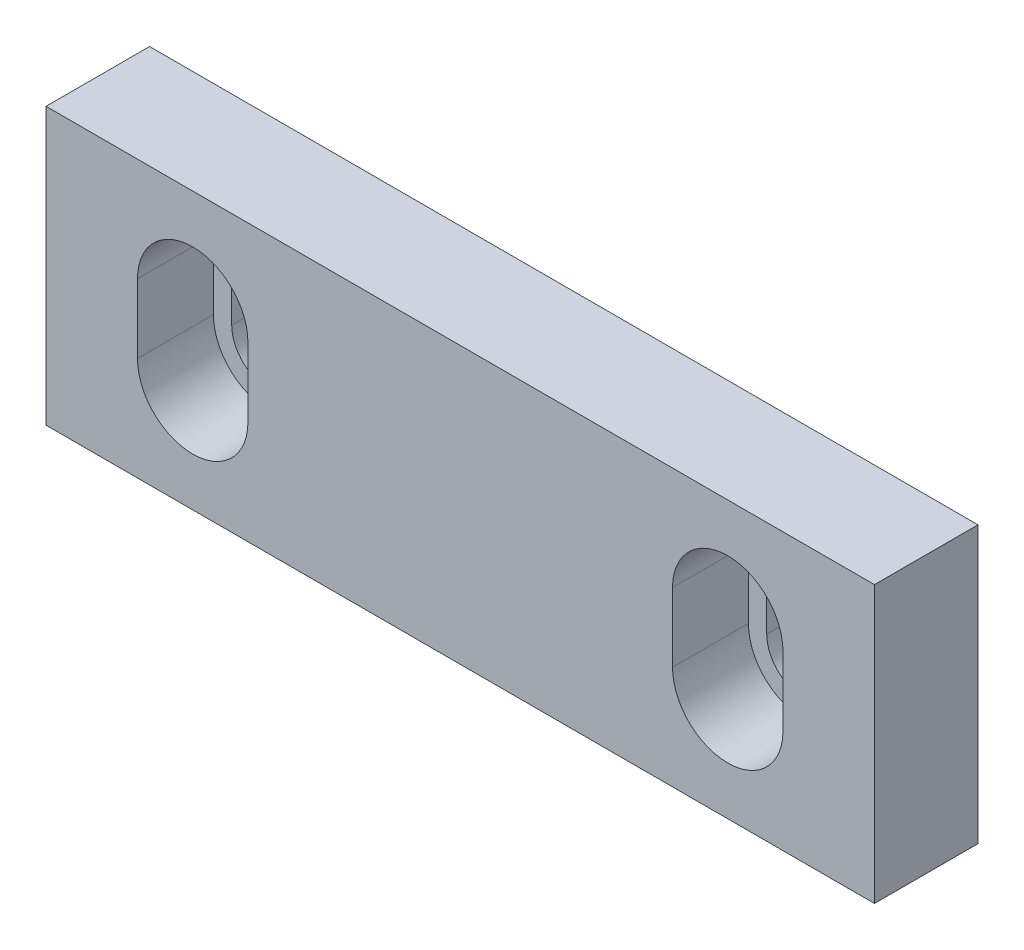
ISO-10303-21;
HEADER;
FILE_DESCRIPTION(('STEP AP214'),'2;1');
FILE_NAME('part.step','',(''),(''),'','','');
FILE_SCHEMA(('AUTOMOTIVE_DESIGN { 1 0 10303 214 1 1 1 1 }'));
ENDSEC;
DATA;
#1=APPLICATION_CONTEXT('core data for automotive mechanical design processes');
#2=APPLICATION_PROTOCOL_DEFINITION('international standard','automotive_design',2000,#1);
#3=PRODUCT_CONTEXT('',#1,'mechanical');
#4=PRODUCT('Part','Part','',(#3));
#5=PRODUCT_RELATED_PRODUCT_CATEGORY('part','',(#4));
#6=PRODUCT_DEFINITION_FORMATION('','',#4);
#7=PRODUCT_DEFINITION_CONTEXT('part definition',#1,'design');
#8=PRODUCT_DEFINITION('design','',#6,#7);
#9=PRODUCT_DEFINITION_SHAPE('','',#8);
#10=(LENGTH_UNIT() NAMED_UNIT(*) SI_UNIT(.MILLI.,.METRE.));
#11=(NAMED_UNIT(*) PLANE_ANGLE_UNIT() SI_UNIT($,.RADIAN.));
#12=(NAMED_UNIT(*) SI_UNIT($,.STERADIAN.) SOLID_ANGLE_UNIT());
#13=UNCERTAINTY_MEASURE_WITH_UNIT(LENGTH_MEASURE(1.E-05),#10,'distance_accuracy_value','');
#14=(GEOMETRIC_REPRESENTATION_CONTEXT(3) GLOBAL_UNCERTAINTY_ASSIGNED_CONTEXT((#13)) GLOBAL_UNIT_ASSIGNED_CONTEXT((#10,
#11,#12)) REPRESENTATION_CONTEXT('',''));
#15=CARTESIAN_POINT('',(0.,0.,0.));
#16=DIRECTION('',(0.,0.,1.));
#17=DIRECTION('',(1.,0.,0.));
#18=AXIS2_PLACEMENT_3D('',#15,#16,#17);
#19=CARTESIAN_POINT('',(0.,25.4,19.05));
#20=DIRECTION('',(0.,-1.,0.));
#21=DIRECTION('',(1.,0.,0.));
#22=AXIS2_PLACEMENT_3D('',#19,#20,#21);
#23=PLANE('',#22);
#24=DIRECTION('',(-1.,0.,0.));
#25=VECTOR('',#24,1.);
#26=CARTESIAN_POINT('',(0.,25.4,0.));
#27=LINE('',#26,#25);
#28=CARTESIAN_POINT('',(76.2,25.4,0.));
#29=VERTEX_POINT('',#28);
#30=CARTESIAN_POINT('',(-76.2,25.4,0.));
#31=VERTEX_POINT('',#30);
#32=EDGE_CURVE('E261',#29,#31,#27,.T.);
#33=ORIENTED_EDGE('',*,*,#32,.T.);
#34=DIRECTION('',(0.,0.,-1.));
#35=VECTOR('',#34,1.);
#36=CARTESIAN_POINT('',(-76.2,25.4,19.05));
#37=LINE('',#36,#35);
#38=CARTESIAN_POINT('',(-76.2,25.4,19.05));
#39=VERTEX_POINT('',#38);
#40=EDGE_CURVE('E11',#39,#31,#37,.T.);
#41=ORIENTED_EDGE('',*,*,#40,.F.);
#42=DIRECTION('',(-1.,0.,0.));
#43=VECTOR('',#42,1.);
#44=CARTESIAN_POINT('',(0.,25.4,19.05));
#45=LINE('',#44,#43);
#46=CARTESIAN_POINT('',(76.2,25.4,19.05));
#47=VERTEX_POINT('',#46);
#48=EDGE_CURVE('E285',#47,#39,#45,.T.);
#49=ORIENTED_EDGE('',*,*,#48,.F.);
#50=DIRECTION('',(0.,0.,-1.));
#51=VECTOR('',#50,1.);
#52=CARTESIAN_POINT('',(76.2,25.4,19.05));
#53=LINE('',#52,#51);
#54=EDGE_CURVE('E307',#47,#29,#53,.T.);
#55=ORIENTED_EDGE('',*,*,#54,.T.);
#56=EDGE_LOOP('',(#33,#41,#49,#55));
#57=FACE_BOUND('',#56,.T.);
#58=ADVANCED_FACE('F35',(#57),#23,.F.);
#59=CARTESIAN_POINT('',(-76.2,0.,19.05));
#60=DIRECTION('',(1.,0.,0.));
#61=DIRECTION('',(0.,0.,-1.));
#62=AXIS2_PLACEMENT_3D('',#59,#60,#61);
#63=PLANE('',#62);
#64=DIRECTION('',(0.,-1.,0.));
#65=VECTOR('',#64,1.);
#66=CARTESIAN_POINT('',(-76.2,0.,0.));
#67=LINE('',#66,#65);
#68=CARTESIAN_POINT('',(-76.2,-25.4,0.));
#69=VERTEX_POINT('',#68);
#70=EDGE_CURVE('E299',#31,#69,#67,.T.);
#71=ORIENTED_EDGE('',*,*,#70,.T.);
#72=DIRECTION('',(0.,0.,-1.));
#73=VECTOR('',#72,1.);
#74=CARTESIAN_POINT('',(-76.2,-25.4,19.05));
#75=LINE('',#74,#73);
#76=CARTESIAN_POINT('',(-76.2,-25.4,19.05));
#77=VERTEX_POINT('',#76);
#78=EDGE_CURVE('E44',#77,#69,#75,.T.);
#79=ORIENTED_EDGE('',*,*,#78,.F.);
#80=DIRECTION('',(0.,-1.,0.));
#81=VECTOR('',#80,1.);
#82=CARTESIAN_POINT('',(-76.2,0.,19.05));
#83=LINE('',#82,#81);
#84=EDGE_CURVE('E288',#39,#77,#83,.T.);
#85=ORIENTED_EDGE('',*,*,#84,.F.);
#86=ORIENTED_EDGE('',*,*,#40,.T.);
#87=EDGE_LOOP('',(#71,#79,#85,#86));
#88=FACE_BOUND('',#87,.T.);
#89=ADVANCED_FACE('F359',(#88),#63,.F.);
#90=CARTESIAN_POINT('',(0.,-25.4,19.05));
#91=DIRECTION('',(0.,-1.,0.));
#92=DIRECTION('',(1.,0.,0.));
#93=AXIS2_PLACEMENT_3D('',#90,#91,#92);
#94=PLANE('',#93);
#95=DIRECTION('',(-1.,0.,0.));
#96=VECTOR('',#95,1.);
#97=CARTESIAN_POINT('',(0.,-25.4,0.));
#98=LINE('',#97,#96);
#99=CARTESIAN_POINT('',(76.2,-25.4,0.));
#100=VERTEX_POINT('',#99);
#101=EDGE_CURVE('E302',#100,#69,#98,.T.);
#102=ORIENTED_EDGE('',*,*,#101,.F.);
#103=DIRECTION('',(0.,0.,-1.));
#104=VECTOR('',#103,1.);
#105=CARTESIAN_POINT('',(76.2,-25.4,19.05));
#106=LINE('',#105,#104);
#107=CARTESIAN_POINT('',(76.2,-25.4,19.05));
#108=VERTEX_POINT('',#107);
#109=EDGE_CURVE('E309',#108,#100,#106,.T.);
#110=ORIENTED_EDGE('',*,*,#109,.F.);
#111=DIRECTION('',(-1.,0.,0.));
#112=VECTOR('',#111,1.);
#113=CARTESIAN_POINT('',(0.,-25.4,19.05));
#114=LINE('',#113,#112);
#115=EDGE_CURVE('E290',#108,#77,#114,.T.);
#116=ORIENTED_EDGE('',*,*,#115,.T.);
#117=ORIENTED_EDGE('',*,*,#78,.T.);
#118=EDGE_LOOP('',(#102,#110,#116,#117));
#119=FACE_BOUND('',#118,.T.);
#120=ADVANCED_FACE('F365',(#119),#94,.T.);
#121=CARTESIAN_POINT('',(-49.2125,6.35,19.05));
#122=DIRECTION('',(0.,0.,-1.));
#123=DIRECTION('',(-1.,0.,0.));
#124=AXIS2_PLACEMENT_3D('',#121,#122,#123);
#125=CYLINDRICAL_SURFACE('',#124,10.16);
#126=CARTESIAN_POINT('',(-49.2125,6.35,5.08));
#127=DIRECTION('',(0.,0.,1.));
#128=DIRECTION('',(1.,0.,0.));
#129=AXIS2_PLACEMENT_3D('',#126,#127,#128);
#130=CIRCLE('',#129,10.16);
#131=CARTESIAN_POINT('',(-39.0525,6.35000000000001,5.08));
#132=VERTEX_POINT('',#131);
#133=CARTESIAN_POINT('',(-59.3725,6.34999999999999,5.08));
#134=VERTEX_POINT('',#133);
#135=EDGE_CURVE('E60',#132,#134,#130,.T.);
#136=ORIENTED_EDGE('',*,*,#135,.F.);
#137=DIRECTION('',(0.,0.,-1.));
#138=VECTOR('',#137,1.);
#139=CARTESIAN_POINT('',(-39.0525,6.35000000000001,19.05));
#140=LINE('',#139,#138);
#141=CARTESIAN_POINT('',(-39.0525,6.35000000000001,19.05));
#142=VERTEX_POINT('',#141);
#143=EDGE_CURVE('E310',#142,#132,#140,.T.);
#144=ORIENTED_EDGE('',*,*,#143,.F.);
#145=CARTESIAN_POINT('',(-49.2125,6.35,19.05));
#146=DIRECTION('',(0.,0.,1.));
#147=DIRECTION('',(1.,0.,0.));
#148=AXIS2_PLACEMENT_3D('',#145,#146,#147);
#149=CIRCLE('',#148,10.16);
#150=CARTESIAN_POINT('',(-59.3725,6.34999999999999,19.05));
#151=VERTEX_POINT('',#150);
#152=EDGE_CURVE('E274',#142,#151,#149,.T.);
#153=ORIENTED_EDGE('',*,*,#152,.T.);
#154=DIRECTION('',(0.,0.,-1.));
#155=VECTOR('',#154,1.);
#156=CARTESIAN_POINT('',(-59.3725,6.34999999999999,19.05));
#157=LINE('',#156,#155);
#158=EDGE_CURVE('E313',#151,#134,#157,.T.);
#159=ORIENTED_EDGE('',*,*,#158,.T.);
#160=EDGE_LOOP('',(#136,#144,#153,#159));
#161=FACE_BOUND('',#160,.T.);
#162=ADVANCED_FACE('F377',(#161),#125,.F.);
#163=CARTESIAN_POINT('',(-39.0525,0.,19.05));
#164=DIRECTION('',(-1.,0.,0.));
#165=DIRECTION('',(0.,-1.,0.));
#166=AXIS2_PLACEMENT_3D('',#163,#164,#165);
#167=PLANE('',#166);
#168=DIRECTION('',(0.,1.,0.));
#169=VECTOR('',#168,1.);
#170=CARTESIAN_POINT('',(-39.0525,0.,5.08));
#171=LINE('',#170,#169);
#172=CARTESIAN_POINT('',(-39.0525,-6.35,5.08));
#173=VERTEX_POINT('',#172);
#174=EDGE_CURVE('E236',#173,#132,#171,.T.);
#175=ORIENTED_EDGE('',*,*,#174,.F.);
#176=DIRECTION('',(0.,0.,-1.));
#177=VECTOR('',#176,1.);
#178=CARTESIAN_POINT('',(-39.0525,-6.35,19.05));
#179=LINE('',#178,#177);
#180=CARTESIAN_POINT('',(-39.0525,-6.35,19.05));
#181=VERTEX_POINT('',#180);
#182=EDGE_CURVE('E319',#181,#173,#179,.T.);
#183=ORIENTED_EDGE('',*,*,#182,.F.);
#184=DIRECTION('',(0.,1.,0.));
#185=VECTOR('',#184,1.);
#186=CARTESIAN_POINT('',(-39.0525,0.,19.05));
#187=LINE('',#186,#185);
#188=EDGE_CURVE('E277',#181,#142,#187,.T.);
#189=ORIENTED_EDGE('',*,*,#188,.T.);
#190=ORIENTED_EDGE('',*,*,#143,.T.);
#191=EDGE_LOOP('',(#175,#183,#189,#190));
#192=FACE_BOUND('',#191,.T.);
#193=ADVANCED_FACE('F373',(#192),#167,.T.);
#194=CARTESIAN_POINT('',(-49.2125,-6.35,19.05));
#195=DIRECTION('',(0.,0.,-1.));
#196=DIRECTION('',(-1.,0.,0.));
#197=AXIS2_PLACEMENT_3D('',#194,#195,#196);
#198=CYLINDRICAL_SURFACE('',#197,10.16);
#199=CARTESIAN_POINT('',(-49.2125,-6.35,5.08));
#200=DIRECTION('',(0.,0.,1.));
#201=DIRECTION('',(1.,0.,0.));
#202=AXIS2_PLACEMENT_3D('',#199,#200,#201);
#203=CIRCLE('',#202,10.16);
#204=CARTESIAN_POINT('',(-59.3725,-6.35000000000001,5.08));
#205=VERTEX_POINT('',#204);
#206=EDGE_CURVE('E241',#205,#173,#203,.T.);
#207=ORIENTED_EDGE('',*,*,#206,.F.);
#208=DIRECTION('',(0.,0.,-1.));
#209=VECTOR('',#208,1.);
#210=CARTESIAN_POINT('',(-59.3725,-6.35000000000001,19.05));
#211=LINE('',#210,#209);
#212=CARTESIAN_POINT('',(-59.3725,-6.35000000000001,19.05));
#213=VERTEX_POINT('',#212);
#214=EDGE_CURVE('E316',#213,#205,#211,.T.);
#215=ORIENTED_EDGE('',*,*,#214,.F.);
#216=CARTESIAN_POINT('',(-49.2125,-6.35,19.05));
#217=DIRECTION('',(0.,0.,1.));
#218=DIRECTION('',(1.,0.,0.));
#219=AXIS2_PLACEMENT_3D('',#216,#217,#218);
#220=CIRCLE('',#219,10.16);
#221=EDGE_CURVE('E280',#213,#181,#220,.T.);
#222=ORIENTED_EDGE('',*,*,#221,.T.);
#223=ORIENTED_EDGE('',*,*,#182,.T.);
#224=EDGE_LOOP('',(#207,#215,#222,#223));
#225=FACE_BOUND('',#224,.T.);
#226=ADVANCED_FACE('F370',(#225),#198,.F.);
#227=CARTESIAN_POINT('',(49.2125,6.35000000000001,19.05));
#228=DIRECTION('',(0.,0.,-1.));
#229=DIRECTION('',(-1.,0.,0.));
#230=AXIS2_PLACEMENT_3D('',#227,#228,#229);
#231=CYLINDRICAL_SURFACE('',#230,10.16);
#232=CARTESIAN_POINT('',(49.2125,6.35000000000001,5.08));
#233=DIRECTION('',(0.,0.,1.));
#234=DIRECTION('',(1.,0.,0.));
#235=AXIS2_PLACEMENT_3D('',#232,#233,#234);
#236=CIRCLE('',#235,10.16);
#237=CARTESIAN_POINT('',(59.3725,6.35000000000001,5.08));
#238=VERTEX_POINT('',#237);
#239=CARTESIAN_POINT('',(39.0525,6.35,5.08));
#240=VERTEX_POINT('',#239);
#241=EDGE_CURVE('E52',#238,#240,#236,.T.);
#242=ORIENTED_EDGE('',*,*,#241,.F.);
#243=DIRECTION('',(0.,0.,-1.));
#244=VECTOR('',#243,1.);
#245=CARTESIAN_POINT('',(59.3725,6.35000000000001,19.05));
#246=LINE('',#245,#244);
#247=CARTESIAN_POINT('',(59.3725,6.35000000000001,19.05));
#248=VERTEX_POINT('',#247);
#249=EDGE_CURVE('E39',#248,#238,#246,.T.);
#250=ORIENTED_EDGE('',*,*,#249,.F.);
#251=CARTESIAN_POINT('',(49.2125,6.35000000000001,19.05));
#252=DIRECTION('',(0.,0.,1.));
#253=DIRECTION('',(1.,0.,0.));
#254=AXIS2_PLACEMENT_3D('',#251,#252,#253);
#255=CIRCLE('',#254,10.16);
#256=CARTESIAN_POINT('',(39.0525,6.35,19.05));
#257=VERTEX_POINT('',#256);
#258=EDGE_CURVE('E262',#248,#257,#255,.T.);
#259=ORIENTED_EDGE('',*,*,#258,.T.);
#260=DIRECTION('',(0.,0.,-1.));
#261=VECTOR('',#260,1.);
#262=CARTESIAN_POINT('',(39.0525,6.35,19.05));
#263=LINE('',#262,#261);
#264=EDGE_CURVE('E296',#257,#240,#263,.T.);
#265=ORIENTED_EDGE('',*,*,#264,.T.);
#266=EDGE_LOOP('',(#242,#250,#259,#265));
#267=FACE_BOUND('',#266,.T.);
#268=ADVANCED_FACE('F37',(#267),#231,.F.);
#269=CARTESIAN_POINT('',(59.3725,0.,19.05));
#270=DIRECTION('',(-1.,0.,0.));
#271=DIRECTION('',(0.,0.,1.));
#272=AXIS2_PLACEMENT_3D('',#269,#270,#271);
#273=PLANE('',#272);
#274=DIRECTION('',(0.,1.,0.));
#275=VECTOR('',#274,1.);
#276=CARTESIAN_POINT('',(59.3725,0.,5.08));
#277=LINE('',#276,#275);
#278=CARTESIAN_POINT('',(59.3725,-6.34999999999999,5.08));
#279=VERTEX_POINT('',#278);
#280=EDGE_CURVE('E207',#279,#238,#277,.T.);
#281=ORIENTED_EDGE('',*,*,#280,.F.);
#282=DIRECTION('',(0.,0.,-1.));
#283=VECTOR('',#282,1.);
#284=CARTESIAN_POINT('',(59.3725,-6.34999999999999,19.05));
#285=LINE('',#284,#283);
#286=CARTESIAN_POINT('',(59.3725,-6.34999999999999,19.05));
#287=VERTEX_POINT('',#286);
#288=EDGE_CURVE('E328',#287,#279,#285,.T.);
#289=ORIENTED_EDGE('',*,*,#288,.F.);
#290=DIRECTION('',(0.,1.,0.));
#291=VECTOR('',#290,1.);
#292=CARTESIAN_POINT('',(59.3725,0.,19.05));
#293=LINE('',#292,#291);
#294=EDGE_CURVE('E265',#287,#248,#293,.T.);
#295=ORIENTED_EDGE('',*,*,#294,.T.);
#296=ORIENTED_EDGE('',*,*,#249,.T.);
#297=EDGE_LOOP('',(#281,#289,#295,#296));
#298=FACE_BOUND('',#297,.T.);
#299=ADVANCED_FACE('F335',(#298),#273,.T.);
#300=CARTESIAN_POINT('',(49.2125,-6.34999999999999,19.05));
#301=DIRECTION('',(0.,0.,-1.));
#302=DIRECTION('',(-1.,0.,0.));
#303=AXIS2_PLACEMENT_3D('',#300,#301,#302);
#304=CYLINDRICAL_SURFACE('',#303,10.16);
#305=CARTESIAN_POINT('',(49.2125,-6.34999999999999,5.08));
#306=DIRECTION('',(0.,0.,1.));
#307=DIRECTION('',(1.,0.,0.));
#308=AXIS2_PLACEMENT_3D('',#305,#306,#307);
#309=CIRCLE('',#308,10.16);
#310=CARTESIAN_POINT('',(39.0525,-6.34999999999999,5.08));
#311=VERTEX_POINT('',#310);
#312=EDGE_CURVE('E212',#311,#279,#309,.T.);
#313=ORIENTED_EDGE('',*,*,#312,.F.);
#314=DIRECTION('',(0.,0.,-1.));
#315=VECTOR('',#314,1.);
#316=CARTESIAN_POINT('',(39.0525,-6.34999999999999,19.05));
#317=LINE('',#316,#315);
#318=CARTESIAN_POINT('',(39.0525,-6.34999999999999,19.05));
#319=VERTEX_POINT('',#318);
#320=EDGE_CURVE('E326',#319,#311,#317,.T.);
#321=ORIENTED_EDGE('',*,*,#320,.F.);
#322=CARTESIAN_POINT('',(49.2125,-6.34999999999999,19.05));
#323=DIRECTION('',(0.,0.,1.));
#324=DIRECTION('',(1.,0.,0.));
#325=AXIS2_PLACEMENT_3D('',#322,#323,#324);
#326=CIRCLE('',#325,10.16);
#327=EDGE_CURVE('E269',#319,#287,#326,.T.);
#328=ORIENTED_EDGE('',*,*,#327,.T.);
#329=ORIENTED_EDGE('',*,*,#288,.T.);
#330=EDGE_LOOP('',(#313,#321,#328,#329));
#331=FACE_BOUND('',#330,.T.);
#332=ADVANCED_FACE('F347',(#331),#304,.F.);
#333=CARTESIAN_POINT('',(-59.3725,0.,19.05));
#334=DIRECTION('',(-1.,0.,0.));
#335=DIRECTION('',(0.,-1.,0.));
#336=AXIS2_PLACEMENT_3D('',#333,#334,#335);
#337=PLANE('',#336);
#338=ORIENTED_EDGE('',*,*,#214,.T.);
#339=DIRECTION('',(0.,1.,0.));
#340=VECTOR('',#339,1.);
#341=CARTESIAN_POINT('',(-59.3725,0.,5.08));
#342=LINE('',#341,#340);
#343=EDGE_CURVE('E239',#205,#134,#342,.T.);
#344=ORIENTED_EDGE('',*,*,#343,.T.);
#345=ORIENTED_EDGE('',*,*,#158,.F.);
#346=DIRECTION('',(0.,1.,0.));
#347=VECTOR('',#346,1.);
#348=CARTESIAN_POINT('',(-59.3725,0.,19.05));
#349=LINE('',#348,#347);
#350=EDGE_CURVE('E283',#213,#151,#349,.T.);
#351=ORIENTED_EDGE('',*,*,#350,.F.);
#352=EDGE_LOOP('',(#338,#344,#345,#351));
#353=FACE_BOUND('',#352,.T.);
#354=ADVANCED_FACE('F349',(#353),#337,.F.);
#355=CARTESIAN_POINT('',(39.0525,0.,19.05));
#356=DIRECTION('',(-1.,0.,0.));
#357=DIRECTION('',(0.,0.,1.));
#358=AXIS2_PLACEMENT_3D('',#355,#356,#357);
#359=PLANE('',#358);
#360=ORIENTED_EDGE('',*,*,#320,.T.);
#361=DIRECTION('',(0.,1.,0.));
#362=VECTOR('',#361,1.);
#363=CARTESIAN_POINT('',(39.0525,0.,5.08));
#364=LINE('',#363,#362);
#365=EDGE_CURVE('E210',#311,#240,#364,.T.);
#366=ORIENTED_EDGE('',*,*,#365,.T.);
#367=ORIENTED_EDGE('',*,*,#264,.F.);
#368=DIRECTION('',(0.,1.,0.));
#369=VECTOR('',#368,1.);
#370=CARTESIAN_POINT('',(39.0525,0.,19.05));
#371=LINE('',#370,#369);
#372=EDGE_CURVE('E272',#319,#257,#371,.T.);
#373=ORIENTED_EDGE('',*,*,#372,.F.);
#374=EDGE_LOOP('',(#360,#366,#367,#373));
#375=FACE_BOUND('',#374,.T.);
#376=ADVANCED_FACE('F346',(#375),#359,.F.);
#377=CARTESIAN_POINT('',(76.2,0.,19.05));
#378=DIRECTION('',(1.,0.,0.));
#379=DIRECTION('',(0.,0.,-1.));
#380=AXIS2_PLACEMENT_3D('',#377,#378,#379);
#381=PLANE('',#380);
#382=DIRECTION('',(0.,-1.,0.));
#383=VECTOR('',#382,1.);
#384=CARTESIAN_POINT('',(76.2,0.,0.));
#385=LINE('',#384,#383);
#386=EDGE_CURVE('E266',#29,#100,#385,.T.);
#387=ORIENTED_EDGE('',*,*,#386,.F.);
#388=ORIENTED_EDGE('',*,*,#54,.F.);
#389=DIRECTION('',(0.,-1.,0.));
#390=VECTOR('',#389,1.);
#391=CARTESIAN_POINT('',(76.2,0.,19.05));
#392=LINE('',#391,#390);
#393=EDGE_CURVE('E293',#47,#108,#392,.T.);
#394=ORIENTED_EDGE('',*,*,#393,.T.);
#395=ORIENTED_EDGE('',*,*,#109,.T.);
#396=EDGE_LOOP('',(#387,#388,#394,#395));
#397=FACE_BOUND('',#396,.T.);
#398=ADVANCED_FACE('F382',(#397),#381,.T.);
#399=CARTESIAN_POINT('',(0.,0.,19.05));
#400=DIRECTION('',(0.,0.,1.));
#401=DIRECTION('',(1.,0.,0.));
#402=AXIS2_PLACEMENT_3D('',#399,#400,#401);
#403=PLANE('',#402);
#404=ORIENTED_EDGE('',*,*,#258,.F.);
#405=ORIENTED_EDGE('',*,*,#294,.F.);
#406=ORIENTED_EDGE('',*,*,#327,.F.);
#407=ORIENTED_EDGE('',*,*,#372,.T.);
#408=EDGE_LOOP('',(#404,#405,#406,#407));
#409=FACE_BOUND('',#408,.T.);
#410=ORIENTED_EDGE('',*,*,#152,.F.);
#411=ORIENTED_EDGE('',*,*,#188,.F.);
#412=ORIENTED_EDGE('',*,*,#221,.F.);
#413=ORIENTED_EDGE('',*,*,#350,.T.);
#414=EDGE_LOOP('',(#410,#411,#412,#413));
#415=FACE_BOUND('',#414,.T.);
#416=ORIENTED_EDGE('',*,*,#48,.T.);
#417=ORIENTED_EDGE('',*,*,#84,.T.);
#418=ORIENTED_EDGE('',*,*,#115,.F.);
#419=ORIENTED_EDGE('',*,*,#393,.F.);
#420=EDGE_LOOP('',(#416,#417,#418,#419));
#421=FACE_BOUND('',#420,.T.);
#422=ADVANCED_FACE('F340',(#409,#415,#421),#403,.T.);
#423=CARTESIAN_POINT('',(0.,0.,0.));
#424=DIRECTION('',(0.,0.,1.));
#425=DIRECTION('',(1.,0.,0.));
#426=AXIS2_PLACEMENT_3D('',#423,#424,#425);
#427=PLANE('',#426);
#428=ORIENTED_EDGE('',*,*,#32,.F.);
#429=ORIENTED_EDGE('',*,*,#386,.T.);
#430=ORIENTED_EDGE('',*,*,#101,.T.);
#431=ORIENTED_EDGE('',*,*,#70,.F.);
#432=EDGE_LOOP('',(#428,#429,#430,#431));
#433=FACE_BOUND('',#432,.T.);
#434=CARTESIAN_POINT('',(-49.2125,-6.35,0.));
#435=DIRECTION('',(0.,0.,1.));
#436=DIRECTION('',(1.,0.,0.));
#437=AXIS2_PLACEMENT_3D('',#434,#435,#436);
#438=CIRCLE('',#437,6.7945);
#439=CARTESIAN_POINT('',(-56.007,-6.35000000000001,0.));
#440=VERTEX_POINT('',#439);
#441=CARTESIAN_POINT('',(-42.418,-6.35,0.));
#442=VERTEX_POINT('',#441);
#443=EDGE_CURVE('E185',#440,#442,#438,.T.);
#444=ORIENTED_EDGE('',*,*,#443,.T.);
#445=DIRECTION('',(0.,1.,0.));
#446=VECTOR('',#445,1.);
#447=CARTESIAN_POINT('',(-42.418,0.,0.));
#448=LINE('',#447,#446);
#449=CARTESIAN_POINT('',(-42.418,6.35,0.));
#450=VERTEX_POINT('',#449);
#451=EDGE_CURVE('E228',#442,#450,#448,.T.);
#452=ORIENTED_EDGE('',*,*,#451,.T.);
#453=CARTESIAN_POINT('',(-49.2125,6.35,0.));
#454=DIRECTION('',(0.,0.,1.));
#455=DIRECTION('',(1.,0.,0.));
#456=AXIS2_PLACEMENT_3D('',#453,#454,#455);
#457=CIRCLE('',#456,6.79450000000001);
#458=CARTESIAN_POINT('',(-56.007,6.34999999999999,0.));
#459=VERTEX_POINT('',#458);
#460=EDGE_CURVE('E249',#450,#459,#457,.T.);
#461=ORIENTED_EDGE('',*,*,#460,.T.);
#462=DIRECTION('',(0.,1.,0.));
#463=VECTOR('',#462,1.);
#464=CARTESIAN_POINT('',(-56.007,0.,0.));
#465=LINE('',#464,#463);
#466=EDGE_CURVE('E246',#440,#459,#465,.T.);
#467=ORIENTED_EDGE('',*,*,#466,.F.);
#468=EDGE_LOOP('',(#444,#452,#461,#467));
#469=FACE_BOUND('',#468,.T.);
#470=CARTESIAN_POINT('',(49.2125,-6.34999999999999,0.));
#471=DIRECTION('',(0.,0.,1.));
#472=DIRECTION('',(1.,0.,0.));
#473=AXIS2_PLACEMENT_3D('',#470,#471,#472);
#474=CIRCLE('',#473,6.79450000000001);
#475=CARTESIAN_POINT('',(42.418,-6.34999999999999,0.));
#476=VERTEX_POINT('',#475);
#477=CARTESIAN_POINT('',(56.007,-6.34999999999999,0.));
#478=VERTEX_POINT('',#477);
#479=EDGE_CURVE('E181',#476,#478,#474,.T.);
#480=ORIENTED_EDGE('',*,*,#479,.T.);
#481=DIRECTION('',(0.,1.,0.));
#482=VECTOR('',#481,1.);
#483=CARTESIAN_POINT('',(56.007,0.,0.));
#484=LINE('',#483,#482);
#485=CARTESIAN_POINT('',(56.007,6.35000000000001,0.));
#486=VERTEX_POINT('',#485);
#487=EDGE_CURVE('E199',#478,#486,#484,.T.);
#488=ORIENTED_EDGE('',*,*,#487,.T.);
#489=CARTESIAN_POINT('',(49.2125,6.35000000000001,0.));
#490=DIRECTION('',(0.,0.,1.));
#491=DIRECTION('',(1.,0.,0.));
#492=AXIS2_PLACEMENT_3D('',#489,#490,#491);
#493=CIRCLE('',#492,6.79450000000001);
#494=CARTESIAN_POINT('',(42.418,6.35,0.));
#495=VERTEX_POINT('',#494);
#496=EDGE_CURVE('E202',#486,#495,#493,.T.);
#497=ORIENTED_EDGE('',*,*,#496,.T.);
#498=DIRECTION('',(0.,1.,0.));
#499=VECTOR('',#498,1.);
#500=CARTESIAN_POINT('',(42.418,0.,0.));
#501=LINE('',#500,#499);
#502=EDGE_CURVE('E216',#476,#495,#501,.T.);
#503=ORIENTED_EDGE('',*,*,#502,.F.);
#504=EDGE_LOOP('',(#480,#488,#497,#503));
#505=FACE_BOUND('',#504,.T.);
#506=ADVANCED_FACE('F391',(#433,#469,#505),#427,.F.);
#507=CARTESIAN_POINT('',(-49.2125,-6.35,5.08));
#508=DIRECTION('',(0.,0.,-1.));
#509=DIRECTION('',(-1.,0.,0.));
#510=AXIS2_PLACEMENT_3D('',#507,#508,#509);
#511=CYLINDRICAL_SURFACE('',#510,6.7945);
#512=ORIENTED_EDGE('',*,*,#443,.F.);
#513=DIRECTION('',(0.,0.,-1.));
#514=VECTOR('',#513,1.);
#515=CARTESIAN_POINT('',(-56.007,-6.35000000000001,5.08));
#516=LINE('',#515,#514);
#517=CARTESIAN_POINT('',(-56.007,-6.35000000000001,5.08));
#518=VERTEX_POINT('',#517);
#519=EDGE_CURVE('E259',#518,#440,#516,.T.);
#520=ORIENTED_EDGE('',*,*,#519,.F.);
#521=CARTESIAN_POINT('',(-49.2125,-6.35,5.08));
#522=DIRECTION('',(0.,0.,1.));
#523=DIRECTION('',(1.,0.,0.));
#524=AXIS2_PLACEMENT_3D('',#521,#522,#523);
#525=CIRCLE('',#524,6.7945);
#526=CARTESIAN_POINT('',(-42.418,-6.35,5.08));
#527=VERTEX_POINT('',#526);
#528=EDGE_CURVE('E224',#518,#527,#525,.T.);
#529=ORIENTED_EDGE('',*,*,#528,.T.);
#530=DIRECTION('',(0.,0.,-1.));
#531=VECTOR('',#530,1.);
#532=CARTESIAN_POINT('',(-42.418,-6.35,5.08));
#533=LINE('',#532,#531);
#534=EDGE_CURVE('E243',#527,#442,#533,.T.);
#535=ORIENTED_EDGE('',*,*,#534,.T.);
#536=EDGE_LOOP('',(#512,#520,#529,#535));
#537=FACE_BOUND('',#536,.T.);
#538=ADVANCED_FACE('F410',(#537),#511,.F.);
#539=CARTESIAN_POINT('',(-56.007,0.,5.08));
#540=DIRECTION('',(-1.,0.,0.));
#541=DIRECTION('',(0.,-1.,0.));
#542=AXIS2_PLACEMENT_3D('',#539,#540,#541);
#543=PLANE('',#542);
#544=ORIENTED_EDGE('',*,*,#466,.T.);
#545=DIRECTION('',(0.,0.,-1.));
#546=VECTOR('',#545,1.);
#547=CARTESIAN_POINT('',(-56.007,6.34999999999999,5.08));
#548=LINE('',#547,#546);
#549=CARTESIAN_POINT('',(-56.007,6.34999999999999,5.08));
#550=VERTEX_POINT('',#549);
#551=EDGE_CURVE('E257',#550,#459,#548,.T.);
#552=ORIENTED_EDGE('',*,*,#551,.F.);
#553=DIRECTION('',(0.,1.,0.));
#554=VECTOR('',#553,1.);
#555=CARTESIAN_POINT('',(-56.007,0.,5.08));
#556=LINE('',#555,#554);
#557=EDGE_CURVE('E227',#518,#550,#556,.T.);
#558=ORIENTED_EDGE('',*,*,#557,.F.);
#559=ORIENTED_EDGE('',*,*,#519,.T.);
#560=EDGE_LOOP('',(#544,#552,#558,#559));
#561=FACE_BOUND('',#560,.T.);
#562=ADVANCED_FACE('F444',(#561),#543,.F.);
#563=CARTESIAN_POINT('',(-49.2125,6.35,5.08));
#564=DIRECTION('',(0.,0.,-1.));
#565=DIRECTION('',(-1.,0.,0.));
#566=AXIS2_PLACEMENT_3D('',#563,#564,#565);
#567=CYLINDRICAL_SURFACE('',#566,6.79450000000001);
#568=ORIENTED_EDGE('',*,*,#460,.F.);
#569=DIRECTION('',(0.,0.,-1.));
#570=VECTOR('',#569,1.);
#571=CARTESIAN_POINT('',(-42.418,6.35,5.08));
#572=LINE('',#571,#570);
#573=CARTESIAN_POINT('',(-42.418,6.35,5.08));
#574=VERTEX_POINT('',#573);
#575=EDGE_CURVE('E255',#574,#450,#572,.T.);
#576=ORIENTED_EDGE('',*,*,#575,.F.);
#577=CARTESIAN_POINT('',(-49.2125,6.35,5.08));
#578=DIRECTION('',(0.,0.,1.));
#579=DIRECTION('',(1.,0.,0.));
#580=AXIS2_PLACEMENT_3D('',#577,#578,#579);
#581=CIRCLE('',#580,6.79450000000001);
#582=EDGE_CURVE('E230',#574,#550,#581,.T.);
#583=ORIENTED_EDGE('',*,*,#582,.T.);
#584=ORIENTED_EDGE('',*,*,#551,.T.);
#585=EDGE_LOOP('',(#568,#576,#583,#584));
#586=FACE_BOUND('',#585,.T.);
#587=ADVANCED_FACE('F440',(#586),#567,.F.);
#588=CARTESIAN_POINT('',(-42.418,0.,5.08));
#589=DIRECTION('',(-1.,0.,0.));
#590=DIRECTION('',(0.,0.,1.));
#591=AXIS2_PLACEMENT_3D('',#588,#589,#590);
#592=PLANE('',#591);
#593=ORIENTED_EDGE('',*,*,#451,.F.);
#594=ORIENTED_EDGE('',*,*,#534,.F.);
#595=DIRECTION('',(0.,1.,0.));
#596=VECTOR('',#595,1.);
#597=CARTESIAN_POINT('',(-42.418,0.,5.08));
#598=LINE('',#597,#596);
#599=EDGE_CURVE('E233',#527,#574,#598,.T.);
#600=ORIENTED_EDGE('',*,*,#599,.T.);
#601=ORIENTED_EDGE('',*,*,#575,.T.);
#602=EDGE_LOOP('',(#593,#594,#600,#601));
#603=FACE_BOUND('',#602,.T.);
#604=ADVANCED_FACE('F436',(#603),#592,.T.);
#605=CARTESIAN_POINT('',(0.,0.,5.08));
#606=DIRECTION('',(0.,0.,1.));
#607=DIRECTION('',(1.,0.,0.));
#608=AXIS2_PLACEMENT_3D('',#605,#606,#607);
#609=PLANE('',#608);
#610=ORIENTED_EDGE('',*,*,#528,.F.);
#611=ORIENTED_EDGE('',*,*,#557,.T.);
#612=ORIENTED_EDGE('',*,*,#582,.F.);
#613=ORIENTED_EDGE('',*,*,#599,.F.);
#614=EDGE_LOOP('',(#610,#611,#612,#613));
#615=FACE_BOUND('',#614,.T.);
#616=ORIENTED_EDGE('',*,*,#174,.T.);
#617=ORIENTED_EDGE('',*,*,#135,.T.);
#618=ORIENTED_EDGE('',*,*,#343,.F.);
#619=ORIENTED_EDGE('',*,*,#206,.T.);
#620=EDGE_LOOP('',(#616,#617,#618,#619));
#621=FACE_BOUND('',#620,.T.);
#622=ADVANCED_FACE('F433',(#615,#621),#609,.T.);
#623=CARTESIAN_POINT('',(49.2125,-6.34999999999999,5.08));
#624=DIRECTION('',(0.,0.,-1.));
#625=DIRECTION('',(-1.,0.,0.));
#626=AXIS2_PLACEMENT_3D('',#623,#624,#625);
#627=CYLINDRICAL_SURFACE('',#626,6.79450000000001);
#628=ORIENTED_EDGE('',*,*,#479,.F.);
#629=DIRECTION('',(0.,0.,-1.));
#630=VECTOR('',#629,1.);
#631=CARTESIAN_POINT('',(42.418,-6.34999999999999,5.08));
#632=LINE('',#631,#630);
#633=CARTESIAN_POINT('',(42.418,-6.34999999999999,5.08));
#634=VERTEX_POINT('',#633);
#635=EDGE_CURVE('E174',#634,#476,#632,.T.);
#636=ORIENTED_EDGE('',*,*,#635,.F.);
#637=CARTESIAN_POINT('',(49.2125,-6.34999999999999,5.08));
#638=DIRECTION('',(0.,0.,1.));
#639=DIRECTION('',(1.,0.,0.));
#640=AXIS2_PLACEMENT_3D('',#637,#638,#639);
#641=CIRCLE('',#640,6.79450000000001);
#642=CARTESIAN_POINT('',(56.007,-6.34999999999999,5.08));
#643=VERTEX_POINT('',#642);
#644=EDGE_CURVE('E178',#634,#643,#641,.T.);
#645=ORIENTED_EDGE('',*,*,#644,.T.);
#646=DIRECTION('',(0.,0.,-1.));
#647=VECTOR('',#646,1.);
#648=CARTESIAN_POINT('',(56.007,-6.34999999999999,5.08));
#649=LINE('',#648,#647);
#650=EDGE_CURVE('E214',#643,#478,#649,.T.);
#651=ORIENTED_EDGE('',*,*,#650,.T.);
#652=EDGE_LOOP('',(#628,#636,#645,#651));
#653=FACE_BOUND('',#652,.T.);
#654=ADVANCED_FACE('F176',(#653),#627,.F.);
#655=CARTESIAN_POINT('',(42.418,0.,5.08));
#656=DIRECTION('',(-1.,0.,0.));
#657=DIRECTION('',(0.,0.,1.));
#658=AXIS2_PLACEMENT_3D('',#655,#656,#657);
#659=PLANE('',#658);
#660=ORIENTED_EDGE('',*,*,#502,.T.);
#661=DIRECTION('',(0.,0.,-1.));
#662=VECTOR('',#661,1.);
#663=CARTESIAN_POINT('',(42.418,6.35,5.08));
#664=LINE('',#663,#662);
#665=CARTESIAN_POINT('',(42.418,6.35,5.08));
#666=VERTEX_POINT('',#665);
#667=EDGE_CURVE('E186',#666,#495,#664,.T.);
#668=ORIENTED_EDGE('',*,*,#667,.F.);
#669=DIRECTION('',(0.,1.,0.));
#670=VECTOR('',#669,1.);
#671=CARTESIAN_POINT('',(42.418,0.,5.08));
#672=LINE('',#671,#670);
#673=EDGE_CURVE('E189',#634,#666,#672,.T.);
#674=ORIENTED_EDGE('',*,*,#673,.F.);
#675=ORIENTED_EDGE('',*,*,#635,.T.);
#676=EDGE_LOOP('',(#660,#668,#674,#675));
#677=FACE_BOUND('',#676,.T.);
#678=ADVANCED_FACE('F190',(#677),#659,.F.);
#679=CARTESIAN_POINT('',(49.2125,6.35000000000001,5.08));
#680=DIRECTION('',(0.,0.,-1.));
#681=DIRECTION('',(-1.,0.,0.));
#682=AXIS2_PLACEMENT_3D('',#679,#680,#681);
#683=CYLINDRICAL_SURFACE('',#682,6.79450000000001);
#684=ORIENTED_EDGE('',*,*,#496,.F.);
#685=DIRECTION('',(0.,0.,-1.));
#686=VECTOR('',#685,1.);
#687=CARTESIAN_POINT('',(56.007,6.35000000000001,5.08));
#688=LINE('',#687,#686);
#689=CARTESIAN_POINT('',(56.007,6.35000000000001,5.08));
#690=VERTEX_POINT('',#689);
#691=EDGE_CURVE('E221',#690,#486,#688,.T.);
#692=ORIENTED_EDGE('',*,*,#691,.F.);
#693=CARTESIAN_POINT('',(49.2125,6.35000000000001,5.08));
#694=DIRECTION('',(0.,0.,1.));
#695=DIRECTION('',(1.,0.,0.));
#696=AXIS2_PLACEMENT_3D('',#693,#694,#695);
#697=CIRCLE('',#696,6.79450000000001);
#698=EDGE_CURVE('E194',#690,#666,#697,.T.);
#699=ORIENTED_EDGE('',*,*,#698,.T.);
#700=ORIENTED_EDGE('',*,*,#667,.T.);
#701=EDGE_LOOP('',(#684,#692,#699,#700));
#702=FACE_BOUND('',#701,.T.);
#703=ADVANCED_FACE('F420',(#702),#683,.F.);
#704=CARTESIAN_POINT('',(56.007,0.,5.08));
#705=DIRECTION('',(-1.,0.,0.));
#706=DIRECTION('',(0.,0.,1.));
#707=AXIS2_PLACEMENT_3D('',#704,#705,#706);
#708=PLANE('',#707);
#709=ORIENTED_EDGE('',*,*,#487,.F.);
#710=ORIENTED_EDGE('',*,*,#650,.F.);
#711=DIRECTION('',(0.,1.,0.));
#712=VECTOR('',#711,1.);
#713=CARTESIAN_POINT('',(56.007,0.,5.08));
#714=LINE('',#713,#712);
#715=EDGE_CURVE('E198',#643,#690,#714,.T.);
#716=ORIENTED_EDGE('',*,*,#715,.T.);
#717=ORIENTED_EDGE('',*,*,#691,.T.);
#718=EDGE_LOOP('',(#709,#710,#716,#717));
#719=FACE_BOUND('',#718,.T.);
#720=ADVANCED_FACE('F417',(#719),#708,.T.);
#721=CARTESIAN_POINT('',(0.,0.,5.08));
#722=DIRECTION('',(0.,0.,1.));
#723=DIRECTION('',(1.,0.,0.));
#724=AXIS2_PLACEMENT_3D('',#721,#722,#723);
#725=PLANE('',#724);
#726=ORIENTED_EDGE('',*,*,#644,.F.);
#727=ORIENTED_EDGE('',*,*,#673,.T.);
#728=ORIENTED_EDGE('',*,*,#698,.F.);
#729=ORIENTED_EDGE('',*,*,#715,.F.);
#730=EDGE_LOOP('',(#726,#727,#728,#729));
#731=FACE_BOUND('',#730,.T.);
#732=ORIENTED_EDGE('',*,*,#280,.T.);
#733=ORIENTED_EDGE('',*,*,#241,.T.);
#734=ORIENTED_EDGE('',*,*,#365,.F.);
#735=ORIENTED_EDGE('',*,*,#312,.T.);
#736=EDGE_LOOP('',(#732,#733,#734,#735));
#737=FACE_BOUND('',#736,.T.);
#738=ADVANCED_FACE('F196',(#731,#737),#725,.T.);
#739=CLOSED_SHELL('',(#58,#89,#120,#162,#193,#226,#268,#299,#332,#354,#376,#398,#422,#506,#538,
#562,#587,#604,#622,#654,#678,#703,#720,#738));
#740=MANIFOLD_SOLID_BREP('B2',#739);
#741=ADVANCED_BREP_SHAPE_REPRESENTATION('',(#18,#740),#14);
#742=SHAPE_DEFINITION_REPRESENTATION(#9,#741);
ENDSEC;
END-ISO-10303-21;
